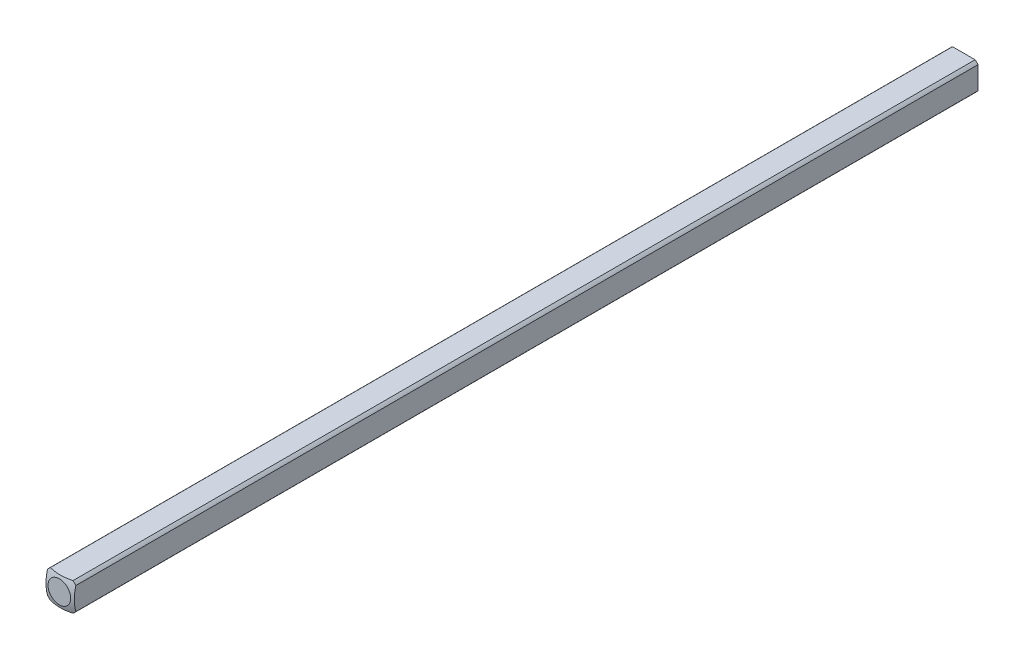
ISO-10303-21;
HEADER;
FILE_DESCRIPTION(('STEP AP214'),'2;1');
FILE_NAME('part.step','',(''),(''),'','','');
FILE_SCHEMA(('AUTOMOTIVE_DESIGN { 1 0 10303 214 1 1 1 1 }'));
ENDSEC;
DATA;
#1=APPLICATION_CONTEXT('core data for automotive mechanical design processes');
#2=APPLICATION_PROTOCOL_DEFINITION('international standard','automotive_design',2000,#1);
#3=PRODUCT_CONTEXT('',#1,'mechanical');
#4=PRODUCT('Part','Part','',(#3));
#5=PRODUCT_RELATED_PRODUCT_CATEGORY('part','',(#4));
#6=PRODUCT_DEFINITION_FORMATION('','',#4);
#7=PRODUCT_DEFINITION_CONTEXT('part definition',#1,'design');
#8=PRODUCT_DEFINITION('design','',#6,#7);
#9=PRODUCT_DEFINITION_SHAPE('','',#8);
#10=(LENGTH_UNIT() NAMED_UNIT(*) SI_UNIT(.MILLI.,.METRE.));
#11=(NAMED_UNIT(*) PLANE_ANGLE_UNIT() SI_UNIT($,.RADIAN.));
#12=(NAMED_UNIT(*) SI_UNIT($,.STERADIAN.) SOLID_ANGLE_UNIT());
#13=UNCERTAINTY_MEASURE_WITH_UNIT(LENGTH_MEASURE(1.E-05),#10,'distance_accuracy_value','');
#14=(GEOMETRIC_REPRESENTATION_CONTEXT(3) GLOBAL_UNCERTAINTY_ASSIGNED_CONTEXT((#13)) GLOBAL_UNIT_ASSIGNED_CONTEXT((#10,
#11,#12)) REPRESENTATION_CONTEXT('',''));
#15=CARTESIAN_POINT('',(0.,0.,0.));
#16=DIRECTION('',(0.,0.,1.));
#17=DIRECTION('',(1.,0.,0.));
#18=AXIS2_PLACEMENT_3D('',#15,#16,#17);
#19=CARTESIAN_POINT('',(-1.5875,-1.5875,152.4));
#20=DIRECTION('',(1.,0.,0.));
#21=DIRECTION('',(0.,0.,-1.));
#22=AXIS2_PLACEMENT_3D('',#19,#20,#21);
#23=PLANE('',#22);
#24=DIRECTION('',(0.,0.,-1.));
#25=VECTOR('',#24,1.);
#26=CARTESIAN_POINT('',(-1.5875,1.26841150657032,152.4));
#27=LINE('',#26,#25);
#28=CARTESIAN_POINT('',(-1.5875,1.26841150657032,203.463225357687));
#29=VERTEX_POINT('',#28);
#30=CARTESIAN_POINT('',(-1.5875,1.26841150657032,304.536774642313));
#31=VERTEX_POINT('',#30);
#32=EDGE_CURVE('E53',#29,#31,#27,.F.);
#33=ORIENTED_EDGE('',*,*,#32,.F.);
#34=DIRECTION('',(0.,-1.,0.));
#35=VECTOR('',#34,1.);
#36=CARTESIAN_POINT('',(-1.5875,-1.58750000000004,203.463225357687));
#37=LINE('',#36,#35);
#38=CARTESIAN_POINT('',(-1.5875,-1.26841150657032,203.463225357687));
#39=VERTEX_POINT('',#38);
#40=EDGE_CURVE('E46',#29,#39,#37,.T.);
#41=ORIENTED_EDGE('',*,*,#40,.T.);
#42=DIRECTION('',(0.,0.,-1.));
#43=VECTOR('',#42,1.);
#44=CARTESIAN_POINT('',(-1.5875,-1.26841150657032,152.4));
#45=LINE('',#44,#43);
#46=CARTESIAN_POINT('',(-1.5875,-1.26841150657032,304.536774642313));
#47=VERTEX_POINT('',#46);
#48=EDGE_CURVE('E40',#47,#39,#45,.T.);
#49=ORIENTED_EDGE('',*,*,#48,.F.);
#50=CARTESIAN_POINT('',(-1.5875,0.,299.880877736238));
#51=DIRECTION('',(-1.,0.,0.));
#52=DIRECTION('',(0.,0.,1.));
#53=AXIS2_PLACEMENT_3D('',#50,#51,#52);
#54=CIRCLE('',#53,4.82558221875869);
#55=EDGE_CURVE('E142',#47,#31,#54,.T.);
#56=ORIENTED_EDGE('',*,*,#55,.T.);
#57=EDGE_LOOP('',(#33,#41,#49,#56));
#58=FACE_BOUND('',#57,.T.);
#59=ADVANCED_FACE('F33',(#58),#23,.F.);
#60=CARTESIAN_POINT('',(-1.5875,-1.5875,152.4));
#61=DIRECTION('',(0.,1.,0.));
#62=DIRECTION('',(0.,0.,1.));
#63=AXIS2_PLACEMENT_3D('',#60,#61,#62);
#64=PLANE('',#63);
#65=DIRECTION('',(0.,0.,-1.));
#66=VECTOR('',#65,1.);
#67=CARTESIAN_POINT('',(-1.26841150657032,-1.5875,152.4));
#68=LINE('',#67,#66);
#69=CARTESIAN_POINT('',(-1.26841150657028,-1.58750000000004,203.463225357687));
#70=VERTEX_POINT('',#69);
#71=CARTESIAN_POINT('',(-1.26841150657032,-1.5875,304.536774642313));
#72=VERTEX_POINT('',#71);
#73=EDGE_CURVE('E120',#70,#72,#68,.F.);
#74=ORIENTED_EDGE('',*,*,#73,.F.);
#75=DIRECTION('',(1.,0.,0.));
#76=VECTOR('',#75,1.);
#77=CARTESIAN_POINT('',(-1.5875,-1.58750000000004,203.463225357687));
#78=LINE('',#77,#76);
#79=CARTESIAN_POINT('',(1.26841150657028,-1.58750000000004,203.463225357687));
#80=VERTEX_POINT('',#79);
#81=EDGE_CURVE('E106',#70,#80,#78,.T.);
#82=ORIENTED_EDGE('',*,*,#81,.T.);
#83=DIRECTION('',(0.,0.,-1.));
#84=VECTOR('',#83,1.);
#85=CARTESIAN_POINT('',(1.26841150657032,-1.5875,152.4));
#86=LINE('',#85,#84);
#87=CARTESIAN_POINT('',(1.26841150657032,-1.5875,304.536774642313));
#88=VERTEX_POINT('',#87);
#89=EDGE_CURVE('E122',#88,#80,#86,.T.);
#90=ORIENTED_EDGE('',*,*,#89,.F.);
#91=CARTESIAN_POINT('',(0.,-1.5875,299.880877736238));
#92=DIRECTION('',(0.,-1.,0.));
#93=DIRECTION('',(0.,0.,-1.));
#94=AXIS2_PLACEMENT_3D('',#91,#92,#93);
#95=CIRCLE('',#94,4.82558221875869);
#96=EDGE_CURVE('E158',#88,#72,#95,.T.);
#97=ORIENTED_EDGE('',*,*,#96,.T.);
#98=EDGE_LOOP('',(#74,#82,#90,#97));
#99=FACE_BOUND('',#98,.T.);
#100=ADVANCED_FACE('F182',(#99),#64,.F.);
#101=CARTESIAN_POINT('',(1.5875,-1.5875,152.4));
#102=DIRECTION('',(-1.,0.,0.));
#103=DIRECTION('',(0.,0.,1.));
#104=AXIS2_PLACEMENT_3D('',#101,#102,#103);
#105=PLANE('',#104);
#106=DIRECTION('',(0.,0.,-1.));
#107=VECTOR('',#106,1.);
#108=CARTESIAN_POINT('',(1.5875,-1.26841150657032,152.4));
#109=LINE('',#108,#107);
#110=CARTESIAN_POINT('',(1.5875,-1.26841150657032,203.463225357687));
#111=VERTEX_POINT('',#110);
#112=CARTESIAN_POINT('',(1.5875,-1.26841150657032,304.536774642313));
#113=VERTEX_POINT('',#112);
#114=EDGE_CURVE('E114',#111,#113,#109,.F.);
#115=ORIENTED_EDGE('',*,*,#114,.F.);
#116=DIRECTION('',(0.,-1.,0.));
#117=VECTOR('',#116,1.);
#118=CARTESIAN_POINT('',(1.5875,-1.58750000000004,203.463225357687));
#119=LINE('',#118,#117);
#120=CARTESIAN_POINT('',(1.5875,1.26841150657032,203.463225357687));
#121=VERTEX_POINT('',#120);
#122=EDGE_CURVE('E98',#121,#111,#119,.T.);
#123=ORIENTED_EDGE('',*,*,#122,.F.);
#124=DIRECTION('',(0.,0.,-1.));
#125=VECTOR('',#124,1.);
#126=CARTESIAN_POINT('',(1.5875,1.26841150657032,152.4));
#127=LINE('',#126,#125);
#128=CARTESIAN_POINT('',(1.5875,1.26841150657032,304.536774642313));
#129=VERTEX_POINT('',#128);
#130=EDGE_CURVE('E112',#129,#121,#127,.T.);
#131=ORIENTED_EDGE('',*,*,#130,.F.);
#132=CARTESIAN_POINT('',(1.5875,0.,299.880877736238));
#133=DIRECTION('',(1.,0.,0.));
#134=DIRECTION('',(0.,0.,-1.));
#135=AXIS2_PLACEMENT_3D('',#132,#133,#134);
#136=CIRCLE('',#135,4.82558221875869);
#137=EDGE_CURVE('E156',#129,#113,#136,.T.);
#138=ORIENTED_EDGE('',*,*,#137,.T.);
#139=EDGE_LOOP('',(#115,#123,#131,#138));
#140=FACE_BOUND('',#139,.T.);
#141=ADVANCED_FACE('F110',(#140),#105,.F.);
#142=CARTESIAN_POINT('',(-1.5875,1.5875,152.4));
#143=DIRECTION('',(0.,-1.,0.));
#144=DIRECTION('',(0.,0.,-1.));
#145=AXIS2_PLACEMENT_3D('',#142,#143,#144);
#146=PLANE('',#145);
#147=DIRECTION('',(0.,0.,-1.));
#148=VECTOR('',#147,1.);
#149=CARTESIAN_POINT('',(1.26841150657032,1.5875,152.4));
#150=LINE('',#149,#148);
#151=CARTESIAN_POINT('',(1.26841150657036,1.58749999999996,203.463225357687));
#152=VERTEX_POINT('',#151);
#153=CARTESIAN_POINT('',(1.26841150657032,1.5875,304.536774642313));
#154=VERTEX_POINT('',#153);
#155=EDGE_CURVE('E169',#152,#154,#150,.F.);
#156=ORIENTED_EDGE('',*,*,#155,.F.);
#157=DIRECTION('',(1.,0.,0.));
#158=VECTOR('',#157,1.);
#159=CARTESIAN_POINT('',(-1.5875,1.58749999999996,203.463225357687));
#160=LINE('',#159,#158);
#161=CARTESIAN_POINT('',(-1.26841150657036,1.58749999999996,203.463225357687));
#162=VERTEX_POINT('',#161);
#163=EDGE_CURVE('E101',#162,#152,#160,.T.);
#164=ORIENTED_EDGE('',*,*,#163,.F.);
#165=DIRECTION('',(0.,0.,-1.));
#166=VECTOR('',#165,1.);
#167=CARTESIAN_POINT('',(-1.26841150657032,1.5875,152.4));
#168=LINE('',#167,#166);
#169=CARTESIAN_POINT('',(-1.26841150657032,1.5875,304.536774642313));
#170=VERTEX_POINT('',#169);
#171=EDGE_CURVE('E124',#170,#162,#168,.T.);
#172=ORIENTED_EDGE('',*,*,#171,.F.);
#173=CARTESIAN_POINT('',(0.,1.5875,299.880877736238));
#174=DIRECTION('',(0.,1.,0.));
#175=DIRECTION('',(0.,0.,1.));
#176=AXIS2_PLACEMENT_3D('',#173,#174,#175);
#177=CIRCLE('',#176,4.82558221875869);
#178=EDGE_CURVE('E150',#170,#154,#177,.T.);
#179=ORIENTED_EDGE('',*,*,#178,.T.);
#180=EDGE_LOOP('',(#156,#164,#172,#179));
#181=FACE_BOUND('',#180,.T.);
#182=ADVANCED_FACE('F174',(#181),#146,.F.);
#183=CARTESIAN_POINT('',(0.,0.,152.4));
#184=DIRECTION('',(0.,0.,-1.));
#185=DIRECTION('',(-1.,0.,0.));
#186=AXIS2_PLACEMENT_3D('',#183,#184,#185);
#187=CYLINDRICAL_SURFACE('',#186,2.032);
#188=CARTESIAN_POINT('',(0.,0.,203.463225357687));
#189=DIRECTION('',(0.,0.,1.));
#190=DIRECTION('',(1.,0.,0.));
#191=AXIS2_PLACEMENT_3D('',#188,#189,#190);
#192=CIRCLE('',#191,2.032);
#193=EDGE_CURVE('E135',#70,#39,#192,.F.);
#194=ORIENTED_EDGE('',*,*,#193,.F.);
#195=ORIENTED_EDGE('',*,*,#73,.T.);
#196=CARTESIAN_POINT('',(0.,0.,304.536774642313));
#197=DIRECTION('',(0.,0.,1.));
#198=DIRECTION('',(1.,0.,0.));
#199=AXIS2_PLACEMENT_3D('',#196,#197,#198);
#200=CIRCLE('',#199,2.032);
#201=EDGE_CURVE('E138',#47,#72,#200,.T.);
#202=ORIENTED_EDGE('',*,*,#201,.F.);
#203=ORIENTED_EDGE('',*,*,#48,.T.);
#204=EDGE_LOOP('',(#194,#195,#202,#203));
#205=FACE_BOUND('',#204,.T.);
#206=ADVANCED_FACE('F134',(#205),#187,.T.);
#207=CARTESIAN_POINT('',(0.,0.,203.463225357687));
#208=DIRECTION('',(0.,0.,1.));
#209=DIRECTION('',(1.,0.,0.));
#210=AXIS2_PLACEMENT_3D('',#207,#208,#209);
#211=CIRCLE('',#210,2.032);
#212=EDGE_CURVE('E105',#111,#80,#211,.F.);
#213=ORIENTED_EDGE('',*,*,#212,.F.);
#214=ORIENTED_EDGE('',*,*,#114,.T.);
#215=CARTESIAN_POINT('',(0.,0.,304.536774642313));
#216=DIRECTION('',(0.,0.,1.));
#217=DIRECTION('',(1.,0.,0.));
#218=AXIS2_PLACEMENT_3D('',#215,#216,#217);
#219=CIRCLE('',#218,2.032);
#220=EDGE_CURVE('E161',#88,#113,#219,.T.);
#221=ORIENTED_EDGE('',*,*,#220,.F.);
#222=ORIENTED_EDGE('',*,*,#89,.T.);
#223=EDGE_LOOP('',(#213,#214,#221,#222));
#224=FACE_BOUND('',#223,.T.);
#225=ADVANCED_FACE('F180',(#224),#187,.T.);
#226=CARTESIAN_POINT('',(0.,0.,203.463225357687));
#227=DIRECTION('',(0.,0.,1.));
#228=DIRECTION('',(1.,0.,0.));
#229=AXIS2_PLACEMENT_3D('',#226,#227,#228);
#230=CIRCLE('',#229,2.032);
#231=EDGE_CURVE('E95',#152,#121,#230,.F.);
#232=ORIENTED_EDGE('',*,*,#231,.F.);
#233=ORIENTED_EDGE('',*,*,#155,.T.);
#234=CARTESIAN_POINT('',(0.,0.,304.536774642313));
#235=DIRECTION('',(0.,0.,1.));
#236=DIRECTION('',(1.,0.,0.));
#237=AXIS2_PLACEMENT_3D('',#234,#235,#236);
#238=CIRCLE('',#237,2.032);
#239=EDGE_CURVE('E118',#129,#154,#238,.T.);
#240=ORIENTED_EDGE('',*,*,#239,.F.);
#241=ORIENTED_EDGE('',*,*,#130,.T.);
#242=EDGE_LOOP('',(#232,#233,#240,#241));
#243=FACE_BOUND('',#242,.T.);
#244=ADVANCED_FACE('F116',(#243),#187,.T.);
#245=CARTESIAN_POINT('',(0.,0.,203.463225357687));
#246=DIRECTION('',(0.,0.,1.));
#247=DIRECTION('',(1.,0.,0.));
#248=AXIS2_PLACEMENT_3D('',#245,#246,#247);
#249=CIRCLE('',#248,2.032);
#250=EDGE_CURVE('E12',#29,#162,#249,.F.);
#251=ORIENTED_EDGE('',*,*,#250,.F.);
#252=ORIENTED_EDGE('',*,*,#32,.T.);
#253=CARTESIAN_POINT('',(0.,0.,304.536774642313));
#254=DIRECTION('',(0.,0.,1.));
#255=DIRECTION('',(1.,0.,0.));
#256=AXIS2_PLACEMENT_3D('',#253,#254,#255);
#257=CIRCLE('',#256,2.032);
#258=EDGE_CURVE('E167',#170,#31,#257,.T.);
#259=ORIENTED_EDGE('',*,*,#258,.F.);
#260=ORIENTED_EDGE('',*,*,#171,.T.);
#261=EDGE_LOOP('',(#251,#252,#259,#260));
#262=FACE_BOUND('',#261,.T.);
#263=ADVANCED_FACE('F171',(#262),#187,.T.);
#264=CARTESIAN_POINT('',(0.,0.,299.880877736238));
#265=DIRECTION('',(0.,0.,-1.));
#266=DIRECTION('',(-1.,0.,0.));
#267=AXIS2_PLACEMENT_3D('',#264,#265,#266);
#268=SPHERICAL_SURFACE('',#267,5.08);
#269=CARTESIAN_POINT('',(0.,0.,304.8));
#270=DIRECTION('',(0.,0.,-1.));
#271=DIRECTION('',(-1.,0.,0.));
#272=AXIS2_PLACEMENT_3D('',#269,#270,#271);
#273=CIRCLE('',#272,1.26832020963187);
#274=CARTESIAN_POINT('',(-1.26832020963187,0.,304.8));
#275=VERTEX_POINT('',#274);
#276=EDGE_CURVE('E164',#275,#275,#273,.T.);
#277=ORIENTED_EDGE('',*,*,#276,.T.);
#278=EDGE_LOOP('',(#277));
#279=FACE_BOUND('',#278,.T.);
#280=ORIENTED_EDGE('',*,*,#96,.F.);
#281=ORIENTED_EDGE('',*,*,#220,.T.);
#282=ORIENTED_EDGE('',*,*,#137,.F.);
#283=ORIENTED_EDGE('',*,*,#239,.T.);
#284=ORIENTED_EDGE('',*,*,#178,.F.);
#285=ORIENTED_EDGE('',*,*,#258,.T.);
#286=ORIENTED_EDGE('',*,*,#55,.F.);
#287=ORIENTED_EDGE('',*,*,#201,.T.);
#288=EDGE_LOOP('',(#280,#281,#282,#283,#284,#285,#286,#287));
#289=FACE_BOUND('',#288,.T.);
#290=ADVANCED_FACE('F177',(#279,#289),#268,.T.);
#291=CARTESIAN_POINT('',(0.,0.,304.8));
#292=DIRECTION('',(0.,0.,1.));
#293=DIRECTION('',(-1.,0.,0.));
#294=AXIS2_PLACEMENT_3D('',#291,#292,#293);
#295=PLANE('',#294);
#296=ORIENTED_EDGE('',*,*,#276,.F.);
#297=EDGE_LOOP('',(#296));
#298=FACE_BOUND('',#297,.T.);
#299=ADVANCED_FACE('F194',(#298),#295,.T.);
#300=CARTESIAN_POINT('',(-1.5875,-1.58750000000004,203.463225357687));
#301=DIRECTION('',(0.,0.,1.));
#302=DIRECTION('',(1.,0.,0.));
#303=AXIS2_PLACEMENT_3D('',#300,#301,#302);
#304=PLANE('',#303);
#305=ORIENTED_EDGE('',*,*,#193,.T.);
#306=ORIENTED_EDGE('',*,*,#40,.F.);
#307=ORIENTED_EDGE('',*,*,#250,.T.);
#308=ORIENTED_EDGE('',*,*,#163,.T.);
#309=ORIENTED_EDGE('',*,*,#231,.T.);
#310=ORIENTED_EDGE('',*,*,#122,.T.);
#311=ORIENTED_EDGE('',*,*,#212,.T.);
#312=ORIENTED_EDGE('',*,*,#81,.F.);
#313=EDGE_LOOP('',(#305,#306,#307,#308,#309,#310,#311,#312));
#314=FACE_BOUND('',#313,.T.);
#315=ADVANCED_FACE('F97',(#314),#304,.F.);
#316=CLOSED_SHELL('',(#59,#100,#141,#182,#206,#225,#244,#263,#290,#299,#315));
#317=MANIFOLD_SOLID_BREP('B2',#316);
#318=ADVANCED_BREP_SHAPE_REPRESENTATION('',(#18,#317),#14);
#319=SHAPE_DEFINITION_REPRESENTATION(#9,#318);
ENDSEC;
END-ISO-10303-21;
